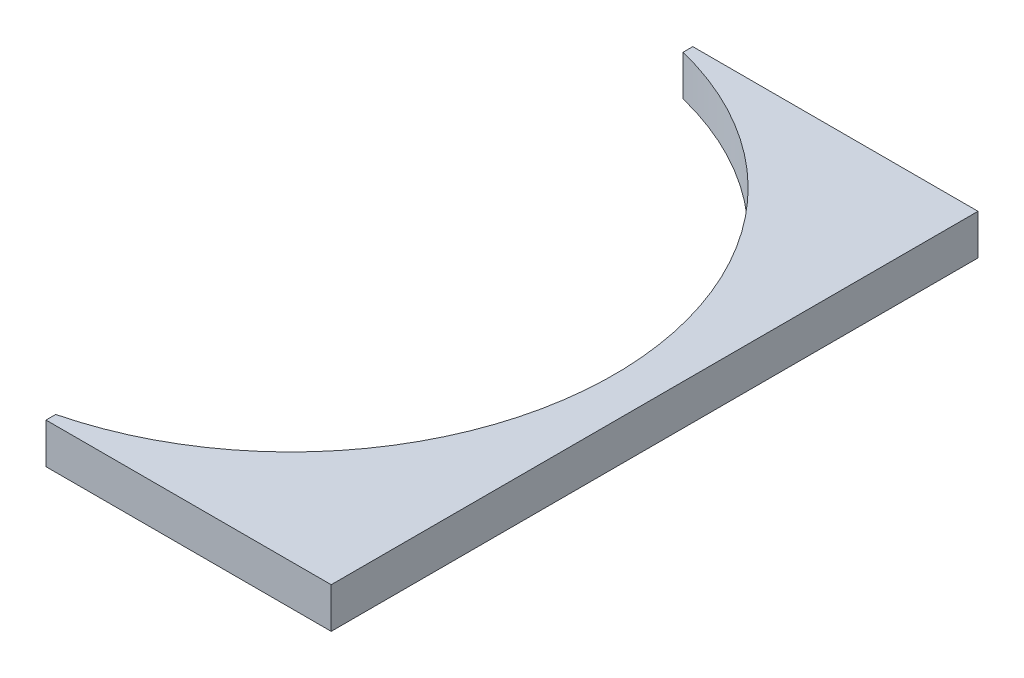
ISO-10303-21;
HEADER;
FILE_DESCRIPTION(('STEP AP214'),'2;1');
FILE_NAME('part.step','',(''),(''),'','','');
FILE_SCHEMA(('AUTOMOTIVE_DESIGN { 1 0 10303 214 1 1 1 1 }'));
ENDSEC;
DATA;
#1=APPLICATION_CONTEXT('core data for automotive mechanical design processes');
#2=APPLICATION_PROTOCOL_DEFINITION('international standard','automotive_design',2000,#1);
#3=PRODUCT_CONTEXT('',#1,'mechanical');
#4=PRODUCT('Part','Part','',(#3));
#5=PRODUCT_RELATED_PRODUCT_CATEGORY('part','',(#4));
#6=PRODUCT_DEFINITION_FORMATION('','',#4);
#7=PRODUCT_DEFINITION_CONTEXT('part definition',#1,'design');
#8=PRODUCT_DEFINITION('design','',#6,#7);
#9=PRODUCT_DEFINITION_SHAPE('','',#8);
#10=(LENGTH_UNIT() NAMED_UNIT(*) SI_UNIT(.MILLI.,.METRE.));
#11=(NAMED_UNIT(*) PLANE_ANGLE_UNIT() SI_UNIT($,.RADIAN.));
#12=(NAMED_UNIT(*) SI_UNIT($,.STERADIAN.) SOLID_ANGLE_UNIT());
#13=UNCERTAINTY_MEASURE_WITH_UNIT(LENGTH_MEASURE(1.E-05),#10,'distance_accuracy_value','');
#14=(GEOMETRIC_REPRESENTATION_CONTEXT(3) GLOBAL_UNCERTAINTY_ASSIGNED_CONTEXT((#13)) GLOBAL_UNIT_ASSIGNED_CONTEXT((#10,
#11,#12)) REPRESENTATION_CONTEXT('',''));
#15=CARTESIAN_POINT('',(0.,0.,0.));
#16=DIRECTION('',(0.,0.,1.));
#17=DIRECTION('',(1.,0.,0.));
#18=AXIS2_PLACEMENT_3D('',#15,#16,#17);
#19=CARTESIAN_POINT('',(0.,3.175,0.));
#20=DIRECTION('',(0.,-1.,0.));
#21=DIRECTION('',(0.,0.,1.));
#22=AXIS2_PLACEMENT_3D('',#19,#20,#21);
#23=CYLINDRICAL_SURFACE('',#22,25.4);
#24=CARTESIAN_POINT('',(0.,0.,0.));
#25=DIRECTION('',(0.,-1.,0.));
#26=DIRECTION('',(0.,0.,-1.));
#27=AXIS2_PLACEMENT_3D('',#24,#25,#26);
#28=CIRCLE('',#27,25.4);
#29=CARTESIAN_POINT('',(6.17486485682075,0.,-24.638));
#30=VERTEX_POINT('',#29);
#31=CARTESIAN_POINT('',(6.17486485682075,0.,24.638));
#32=VERTEX_POINT('',#31);
#33=EDGE_CURVE('E120',#30,#32,#28,.T.);
#34=ORIENTED_EDGE('',*,*,#33,.T.);
#35=DIRECTION('',(0.,-1.,0.));
#36=VECTOR('',#35,1.);
#37=CARTESIAN_POINT('',(6.17486485682075,3.175,24.638));
#38=LINE('',#37,#36);
#39=CARTESIAN_POINT('',(6.17486485682075,3.175,24.638));
#40=VERTEX_POINT('',#39);
#41=EDGE_CURVE('E119',#40,#32,#38,.T.);
#42=ORIENTED_EDGE('',*,*,#41,.F.);
#43=CARTESIAN_POINT('',(0.,3.175,0.));
#44=DIRECTION('',(0.,-1.,0.));
#45=DIRECTION('',(0.,0.,-1.));
#46=AXIS2_PLACEMENT_3D('',#43,#44,#45);
#47=CIRCLE('',#46,25.4);
#48=CARTESIAN_POINT('',(6.17486485682075,3.175,-24.638));
#49=VERTEX_POINT('',#48);
#50=EDGE_CURVE('E131',#49,#40,#47,.T.);
#51=ORIENTED_EDGE('',*,*,#50,.F.);
#52=DIRECTION('',(0.,-1.,0.));
#53=VECTOR('',#52,1.);
#54=CARTESIAN_POINT('',(6.17486485682075,3.175,-24.638));
#55=LINE('',#54,#53);
#56=EDGE_CURVE('E11',#49,#30,#55,.T.);
#57=ORIENTED_EDGE('',*,*,#56,.T.);
#58=EDGE_LOOP('',(#34,#42,#51,#57));
#59=FACE_BOUND('',#58,.T.);
#60=ADVANCED_FACE('F37',(#59),#23,.F.);
#61=CARTESIAN_POINT('',(6.17486485682075,3.175,0.));
#62=DIRECTION('',(-1.,0.,0.));
#63=DIRECTION('',(0.,0.,-1.));
#64=AXIS2_PLACEMENT_3D('',#61,#62,#63);
#65=PLANE('',#64);
#66=DIRECTION('',(0.,0.,1.));
#67=VECTOR('',#66,1.);
#68=CARTESIAN_POINT('',(6.17486485682075,0.,0.));
#69=LINE('',#68,#67);
#70=CARTESIAN_POINT('',(6.17486485682075,0.,-25.4));
#71=VERTEX_POINT('',#70);
#72=EDGE_CURVE('E123',#71,#30,#69,.T.);
#73=ORIENTED_EDGE('',*,*,#72,.T.);
#74=ORIENTED_EDGE('',*,*,#56,.F.);
#75=DIRECTION('',(0.,0.,1.));
#76=VECTOR('',#75,1.);
#77=CARTESIAN_POINT('',(6.17486485682075,3.175,0.));
#78=LINE('',#77,#76);
#79=CARTESIAN_POINT('',(6.17486485682075,3.175,-25.4));
#80=VERTEX_POINT('',#79);
#81=EDGE_CURVE('E85',#80,#49,#78,.T.);
#82=ORIENTED_EDGE('',*,*,#81,.F.);
#83=DIRECTION('',(0.,-1.,0.));
#84=VECTOR('',#83,1.);
#85=CARTESIAN_POINT('',(6.17486485682075,3.175,-25.4));
#86=LINE('',#85,#84);
#87=EDGE_CURVE('E45',#80,#71,#86,.T.);
#88=ORIENTED_EDGE('',*,*,#87,.T.);
#89=EDGE_LOOP('',(#73,#74,#82,#88));
#90=FACE_BOUND('',#89,.T.);
#91=ADVANCED_FACE('F138',(#90),#65,.T.);
#92=CARTESIAN_POINT('',(0.,3.175,-25.4));
#93=DIRECTION('',(0.,0.,-1.));
#94=DIRECTION('',(1.,0.,0.));
#95=AXIS2_PLACEMENT_3D('',#92,#93,#94);
#96=PLANE('',#95);
#97=DIRECTION('',(-1.,0.,0.));
#98=VECTOR('',#97,1.);
#99=CARTESIAN_POINT('',(0.,0.,-25.4));
#100=LINE('',#99,#98);
#101=CARTESIAN_POINT('',(28.575,0.,-25.4));
#102=VERTEX_POINT('',#101);
#103=EDGE_CURVE('E125',#102,#71,#100,.T.);
#104=ORIENTED_EDGE('',*,*,#103,.T.);
#105=ORIENTED_EDGE('',*,*,#87,.F.);
#106=DIRECTION('',(-1.,0.,0.));
#107=VECTOR('',#106,1.);
#108=CARTESIAN_POINT('',(0.,3.175,-25.4));
#109=LINE('',#108,#107);
#110=CARTESIAN_POINT('',(28.575,3.175,-25.4));
#111=VERTEX_POINT('',#110);
#112=EDGE_CURVE('E113',#111,#80,#109,.T.);
#113=ORIENTED_EDGE('',*,*,#112,.F.);
#114=DIRECTION('',(0.,-1.,0.));
#115=VECTOR('',#114,1.);
#116=CARTESIAN_POINT('',(28.575,3.175,-25.4));
#117=LINE('',#116,#115);
#118=EDGE_CURVE('E107',#111,#102,#117,.T.);
#119=ORIENTED_EDGE('',*,*,#118,.T.);
#120=EDGE_LOOP('',(#104,#105,#113,#119));
#121=FACE_BOUND('',#120,.T.);
#122=ADVANCED_FACE('F160',(#121),#96,.T.);
#123=CARTESIAN_POINT('',(28.575,3.175,0.));
#124=DIRECTION('',(1.,0.,0.));
#125=DIRECTION('',(0.,0.,1.));
#126=AXIS2_PLACEMENT_3D('',#123,#124,#125);
#127=PLANE('',#126);
#128=DIRECTION('',(0.,0.,-1.));
#129=VECTOR('',#128,1.);
#130=CARTESIAN_POINT('',(28.575,0.,0.));
#131=LINE('',#130,#129);
#132=CARTESIAN_POINT('',(28.575,0.,25.4));
#133=VERTEX_POINT('',#132);
#134=EDGE_CURVE('E127',#133,#102,#131,.T.);
#135=ORIENTED_EDGE('',*,*,#134,.T.);
#136=ORIENTED_EDGE('',*,*,#118,.F.);
#137=DIRECTION('',(0.,0.,-1.));
#138=VECTOR('',#137,1.);
#139=CARTESIAN_POINT('',(28.575,3.175,0.));
#140=LINE('',#139,#138);
#141=CARTESIAN_POINT('',(28.575,3.175,25.4));
#142=VERTEX_POINT('',#141);
#143=EDGE_CURVE('E97',#142,#111,#140,.T.);
#144=ORIENTED_EDGE('',*,*,#143,.F.);
#145=DIRECTION('',(0.,-1.,0.));
#146=VECTOR('',#145,1.);
#147=CARTESIAN_POINT('',(28.575,3.175,25.4));
#148=LINE('',#147,#146);
#149=EDGE_CURVE('E102',#142,#133,#148,.T.);
#150=ORIENTED_EDGE('',*,*,#149,.T.);
#151=EDGE_LOOP('',(#135,#136,#144,#150));
#152=FACE_BOUND('',#151,.T.);
#153=ADVANCED_FACE('F110',(#152),#127,.T.);
#154=CARTESIAN_POINT('',(0.,3.175,25.4));
#155=DIRECTION('',(0.,0.,1.));
#156=DIRECTION('',(-1.,0.,0.));
#157=AXIS2_PLACEMENT_3D('',#154,#155,#156);
#158=PLANE('',#157);
#159=DIRECTION('',(1.,0.,0.));
#160=VECTOR('',#159,1.);
#161=CARTESIAN_POINT('',(0.,0.,25.4));
#162=LINE('',#161,#160);
#163=CARTESIAN_POINT('',(6.17486485682075,0.,25.4));
#164=VERTEX_POINT('',#163);
#165=EDGE_CURVE('E104',#164,#133,#162,.T.);
#166=ORIENTED_EDGE('',*,*,#165,.T.);
#167=ORIENTED_EDGE('',*,*,#149,.F.);
#168=DIRECTION('',(1.,0.,0.));
#169=VECTOR('',#168,1.);
#170=CARTESIAN_POINT('',(0.,3.175,25.4));
#171=LINE('',#170,#169);
#172=CARTESIAN_POINT('',(6.17486485682075,3.175,25.4));
#173=VERTEX_POINT('',#172);
#174=EDGE_CURVE('E93',#173,#142,#171,.T.);
#175=ORIENTED_EDGE('',*,*,#174,.F.);
#176=DIRECTION('',(0.,-1.,0.));
#177=VECTOR('',#176,1.);
#178=CARTESIAN_POINT('',(6.17486485682075,3.175,25.4));
#179=LINE('',#178,#177);
#180=EDGE_CURVE('E108',#173,#164,#179,.T.);
#181=ORIENTED_EDGE('',*,*,#180,.T.);
#182=EDGE_LOOP('',(#166,#167,#175,#181));
#183=FACE_BOUND('',#182,.T.);
#184=ADVANCED_FACE('F103',(#183),#158,.T.);
#185=CARTESIAN_POINT('',(6.17486485682075,3.175,0.));
#186=DIRECTION('',(1.,0.,0.));
#187=DIRECTION('',(0.,0.,1.));
#188=AXIS2_PLACEMENT_3D('',#185,#186,#187);
#189=PLANE('',#188);
#190=DIRECTION('',(0.,0.,-1.));
#191=VECTOR('',#190,1.);
#192=CARTESIAN_POINT('',(6.17486485682075,0.,0.));
#193=LINE('',#192,#191);
#194=EDGE_CURVE('E73',#164,#32,#193,.T.);
#195=ORIENTED_EDGE('',*,*,#194,.F.);
#196=ORIENTED_EDGE('',*,*,#180,.F.);
#197=DIRECTION('',(0.,0.,-1.));
#198=VECTOR('',#197,1.);
#199=CARTESIAN_POINT('',(6.17486485682075,3.175,0.));
#200=LINE('',#199,#198);
#201=EDGE_CURVE('E53',#173,#40,#200,.T.);
#202=ORIENTED_EDGE('',*,*,#201,.T.);
#203=ORIENTED_EDGE('',*,*,#41,.T.);
#204=EDGE_LOOP('',(#195,#196,#202,#203));
#205=FACE_BOUND('',#204,.T.);
#206=ADVANCED_FACE('F146',(#205),#189,.F.);
#207=CARTESIAN_POINT('',(0.,3.175,0.));
#208=DIRECTION('',(0.,1.,0.));
#209=DIRECTION('',(0.,0.,-1.));
#210=AXIS2_PLACEMENT_3D('',#207,#208,#209);
#211=PLANE('',#210);
#212=ORIENTED_EDGE('',*,*,#50,.T.);
#213=ORIENTED_EDGE('',*,*,#201,.F.);
#214=ORIENTED_EDGE('',*,*,#174,.T.);
#215=ORIENTED_EDGE('',*,*,#143,.T.);
#216=ORIENTED_EDGE('',*,*,#112,.T.);
#217=ORIENTED_EDGE('',*,*,#81,.T.);
#218=EDGE_LOOP('',(#212,#213,#214,#215,#216,#217));
#219=FACE_BOUND('',#218,.T.);
#220=ADVANCED_FACE('F95',(#219),#211,.T.);
#221=CARTESIAN_POINT('',(0.,0.,0.));
#222=DIRECTION('',(0.,1.,0.));
#223=DIRECTION('',(0.,0.,-1.));
#224=AXIS2_PLACEMENT_3D('',#221,#222,#223);
#225=PLANE('',#224);
#226=ORIENTED_EDGE('',*,*,#33,.F.);
#227=ORIENTED_EDGE('',*,*,#72,.F.);
#228=ORIENTED_EDGE('',*,*,#103,.F.);
#229=ORIENTED_EDGE('',*,*,#134,.F.);
#230=ORIENTED_EDGE('',*,*,#165,.F.);
#231=ORIENTED_EDGE('',*,*,#194,.T.);
#232=EDGE_LOOP('',(#226,#227,#228,#229,#230,#231));
#233=FACE_BOUND('',#232,.T.);
#234=ADVANCED_FACE('F141',(#233),#225,.F.);
#235=CLOSED_SHELL('',(#60,#91,#122,#153,#184,#206,#220,#234));
#236=MANIFOLD_SOLID_BREP('B2',#235);
#237=ADVANCED_BREP_SHAPE_REPRESENTATION('',(#18,#236),#14);
#238=SHAPE_DEFINITION_REPRESENTATION(#9,#237);
ENDSEC;
END-ISO-10303-21;
